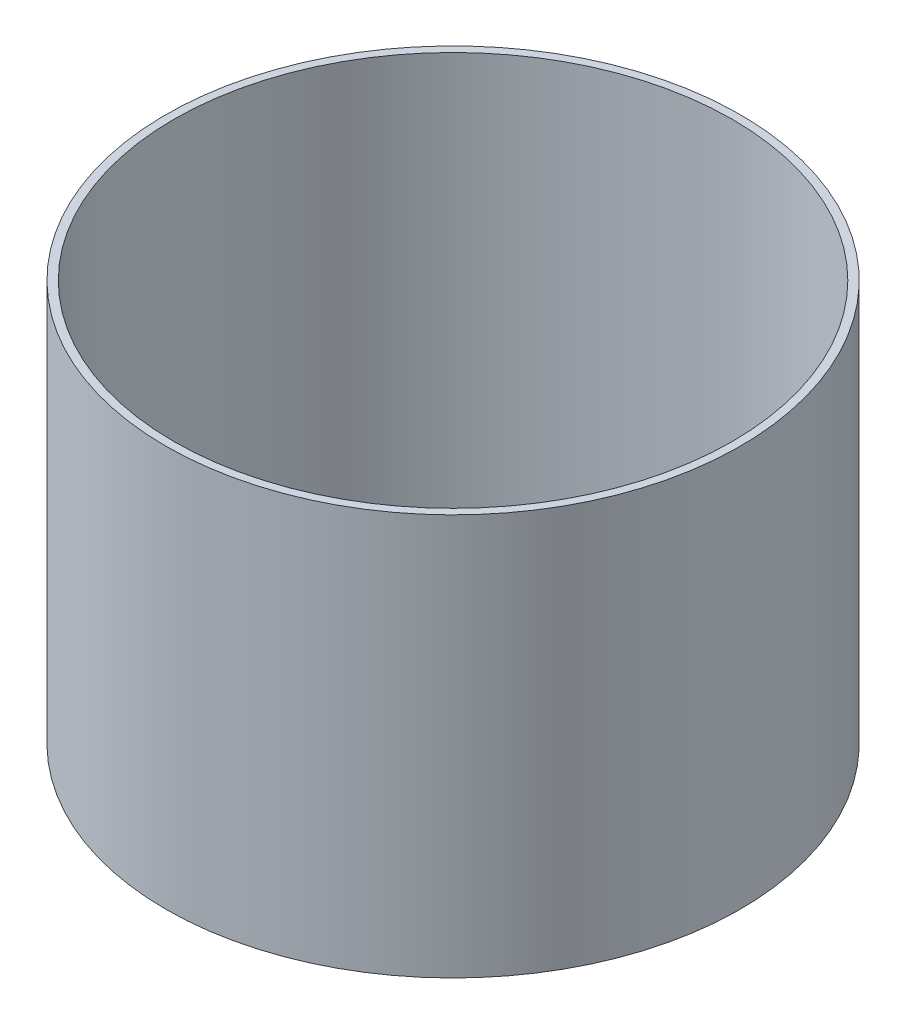
ISO-10303-21;
HEADER;
FILE_DESCRIPTION(('STEP AP214'),'2;1');
FILE_NAME('part.step','',(''),(''),'','','');
FILE_SCHEMA(('AUTOMOTIVE_DESIGN { 1 0 10303 214 1 1 1 1 }'));
ENDSEC;
DATA;
#1=APPLICATION_CONTEXT('core data for automotive mechanical design processes');
#2=APPLICATION_PROTOCOL_DEFINITION('international standard','automotive_design',2000,#1);
#3=PRODUCT_CONTEXT('',#1,'mechanical');
#4=PRODUCT('Part','Part','',(#3));
#5=PRODUCT_RELATED_PRODUCT_CATEGORY('part','',(#4));
#6=PRODUCT_DEFINITION_FORMATION('','',#4);
#7=PRODUCT_DEFINITION_CONTEXT('part definition',#1,'design');
#8=PRODUCT_DEFINITION('design','',#6,#7);
#9=PRODUCT_DEFINITION_SHAPE('','',#8);
#10=(LENGTH_UNIT() NAMED_UNIT(*) SI_UNIT(.MILLI.,.METRE.));
#11=(NAMED_UNIT(*) PLANE_ANGLE_UNIT() SI_UNIT($,.RADIAN.));
#12=(NAMED_UNIT(*) SI_UNIT($,.STERADIAN.) SOLID_ANGLE_UNIT());
#13=UNCERTAINTY_MEASURE_WITH_UNIT(LENGTH_MEASURE(1.E-05),#10,'distance_accuracy_value','');
#14=(GEOMETRIC_REPRESENTATION_CONTEXT(3) GLOBAL_UNCERTAINTY_ASSIGNED_CONTEXT((#13)) GLOBAL_UNIT_ASSIGNED_CONTEXT((#10,
#11,#12)) REPRESENTATION_CONTEXT('',''));
#15=CARTESIAN_POINT('',(0.,0.,0.));
#16=DIRECTION('',(0.,0.,1.));
#17=DIRECTION('',(1.,0.,0.));
#18=AXIS2_PLACEMENT_3D('',#15,#16,#17);
#19=CARTESIAN_POINT('',(0.,12.5,0.));
#20=DIRECTION('',(0.,1.,0.));
#21=DIRECTION('',(0.,0.,1.));
#22=AXIS2_PLACEMENT_3D('',#19,#20,#21);
#23=PLANE('',#22);
#24=CARTESIAN_POINT('',(0.,12.5,0.));
#25=DIRECTION('',(0.,1.,0.));
#26=DIRECTION('',(0.,0.,1.));
#27=AXIS2_PLACEMENT_3D('',#24,#25,#26);
#28=CIRCLE('',#27,8.95);
#29=CARTESIAN_POINT('',(0.,12.5,8.95));
#30=VERTEX_POINT('',#29);
#31=EDGE_CURVE('E10',#30,#30,#28,.T.);
#32=ORIENTED_EDGE('',*,*,#31,.T.);
#33=EDGE_LOOP('',(#32));
#34=FACE_BOUND('',#33,.T.);
#35=CARTESIAN_POINT('',(0.,12.5,0.));
#36=DIRECTION('',(0.,1.,0.));
#37=DIRECTION('',(0.,0.,1.));
#38=AXIS2_PLACEMENT_3D('',#35,#36,#37);
#39=CIRCLE('',#38,8.7);
#40=CARTESIAN_POINT('',(0.,12.5,8.7));
#41=VERTEX_POINT('',#40);
#42=EDGE_CURVE('E46',#41,#41,#39,.T.);
#43=ORIENTED_EDGE('',*,*,#42,.F.);
#44=EDGE_LOOP('',(#43));
#45=FACE_BOUND('',#44,.T.);
#46=ADVANCED_FACE('F35',(#34,#45),#23,.T.);
#47=CARTESIAN_POINT('',(0.,0.,0.));
#48=DIRECTION('',(0.,1.,0.));
#49=DIRECTION('',(0.,0.,1.));
#50=AXIS2_PLACEMENT_3D('',#47,#48,#49);
#51=PLANE('',#50);
#52=CARTESIAN_POINT('',(0.,0.,0.));
#53=DIRECTION('',(0.,1.,0.));
#54=DIRECTION('',(0.,0.,1.));
#55=AXIS2_PLACEMENT_3D('',#52,#53,#54);
#56=CIRCLE('',#55,8.95);
#57=CARTESIAN_POINT('',(0.,0.,8.95));
#58=VERTEX_POINT('',#57);
#59=EDGE_CURVE('E39',#58,#58,#56,.T.);
#60=ORIENTED_EDGE('',*,*,#59,.F.);
#61=EDGE_LOOP('',(#60));
#62=FACE_BOUND('',#61,.T.);
#63=CARTESIAN_POINT('',(0.,0.,0.));
#64=DIRECTION('',(0.,1.,0.));
#65=DIRECTION('',(0.,0.,1.));
#66=AXIS2_PLACEMENT_3D('',#63,#64,#65);
#67=CIRCLE('',#66,8.7);
#68=CARTESIAN_POINT('',(0.,0.,8.7));
#69=VERTEX_POINT('',#68);
#70=EDGE_CURVE('E48',#69,#69,#67,.T.);
#71=ORIENTED_EDGE('',*,*,#70,.T.);
#72=EDGE_LOOP('',(#71));
#73=FACE_BOUND('',#72,.T.);
#74=ADVANCED_FACE('F58',(#62,#73),#51,.F.);
#75=CARTESIAN_POINT('',(0.,12.5,0.));
#76=DIRECTION('',(0.,-1.,0.));
#77=DIRECTION('',(0.,0.,-1.));
#78=AXIS2_PLACEMENT_3D('',#75,#76,#77);
#79=CYLINDRICAL_SURFACE('',#78,8.95);
#80=ORIENTED_EDGE('',*,*,#31,.F.);
#81=EDGE_LOOP('',(#80));
#82=FACE_BOUND('',#81,.T.);
#83=ORIENTED_EDGE('',*,*,#59,.T.);
#84=EDGE_LOOP('',(#83));
#85=FACE_BOUND('',#84,.T.);
#86=ADVANCED_FACE('F37',(#82,#85),#79,.T.);
#87=CARTESIAN_POINT('',(0.,12.5,0.));
#88=DIRECTION('',(0.,-1.,0.));
#89=DIRECTION('',(0.,0.,-1.));
#90=AXIS2_PLACEMENT_3D('',#87,#88,#89);
#91=CYLINDRICAL_SURFACE('',#90,8.7);
#92=ORIENTED_EDGE('',*,*,#42,.T.);
#93=EDGE_LOOP('',(#92));
#94=FACE_BOUND('',#93,.T.);
#95=ORIENTED_EDGE('',*,*,#70,.F.);
#96=EDGE_LOOP('',(#95));
#97=FACE_BOUND('',#96,.T.);
#98=ADVANCED_FACE('F54',(#94,#97),#91,.F.);
#99=CLOSED_SHELL('',(#46,#74,#86,#98));
#100=MANIFOLD_SOLID_BREP('B2',#99);
#101=ADVANCED_BREP_SHAPE_REPRESENTATION('',(#18,#100),#14);
#102=SHAPE_DEFINITION_REPRESENTATION(#9,#101);
ENDSEC;
END-ISO-10303-21;
